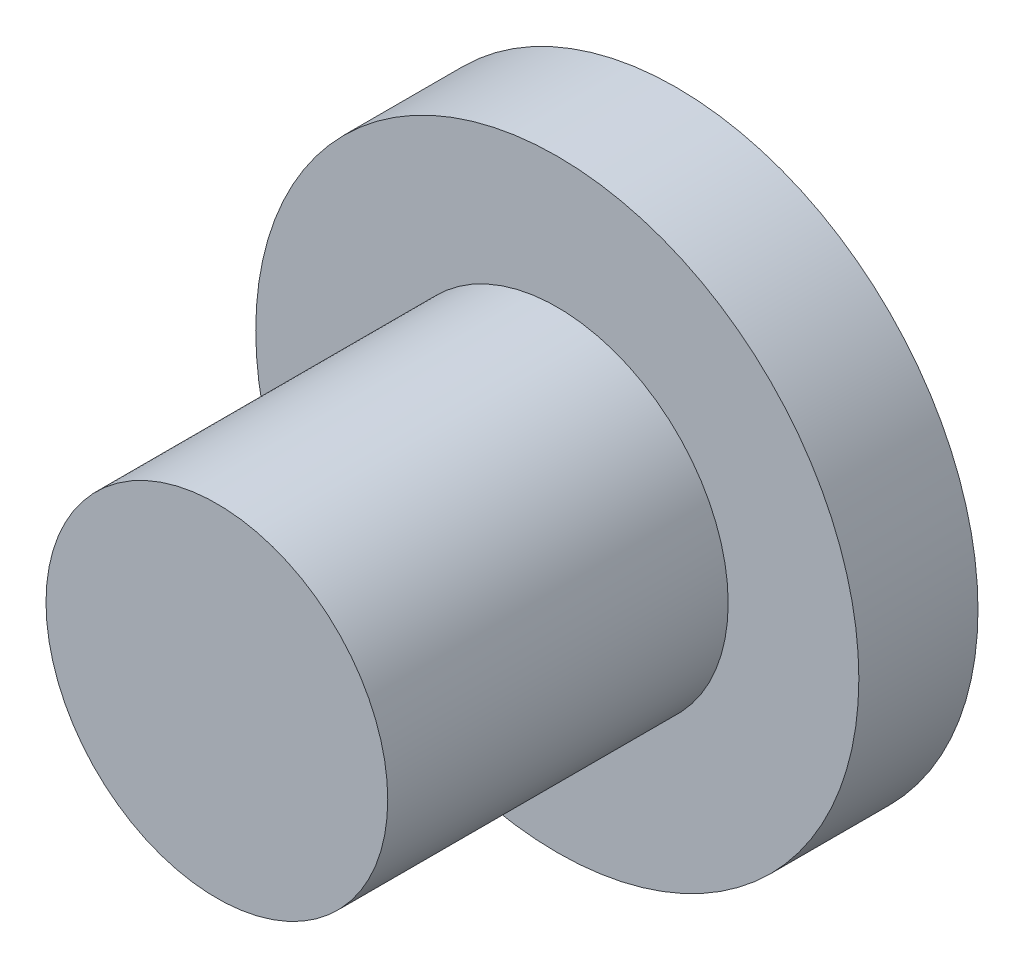
ISO-10303-21;
HEADER;
FILE_DESCRIPTION(('STEP AP214'),'2;1');
FILE_NAME('part.step','',(''),(''),'','','');
FILE_SCHEMA(('AUTOMOTIVE_DESIGN { 1 0 10303 214 1 1 1 1 }'));
ENDSEC;
DATA;
#1=APPLICATION_CONTEXT('core data for automotive mechanical design processes');
#2=APPLICATION_PROTOCOL_DEFINITION('international standard','automotive_design',2000,#1);
#3=PRODUCT_CONTEXT('',#1,'mechanical');
#4=PRODUCT('Part','Part','',(#3));
#5=PRODUCT_RELATED_PRODUCT_CATEGORY('part','',(#4));
#6=PRODUCT_DEFINITION_FORMATION('','',#4);
#7=PRODUCT_DEFINITION_CONTEXT('part definition',#1,'design');
#8=PRODUCT_DEFINITION('design','',#6,#7);
#9=PRODUCT_DEFINITION_SHAPE('','',#8);
#10=(LENGTH_UNIT() NAMED_UNIT(*) SI_UNIT(.MILLI.,.METRE.));
#11=(NAMED_UNIT(*) PLANE_ANGLE_UNIT() SI_UNIT($,.RADIAN.));
#12=(NAMED_UNIT(*) SI_UNIT($,.STERADIAN.) SOLID_ANGLE_UNIT());
#13=UNCERTAINTY_MEASURE_WITH_UNIT(LENGTH_MEASURE(1.E-05),#10,'distance_accuracy_value','');
#14=(GEOMETRIC_REPRESENTATION_CONTEXT(3) GLOBAL_UNCERTAINTY_ASSIGNED_CONTEXT((#13)) GLOBAL_UNIT_ASSIGNED_CONTEXT((#10,
#11,#12)) REPRESENTATION_CONTEXT('',''));
#15=CARTESIAN_POINT('',(0.,0.,0.));
#16=DIRECTION('',(0.,0.,1.));
#17=DIRECTION('',(1.,0.,0.));
#18=AXIS2_PLACEMENT_3D('',#15,#16,#17);
#19=CARTESIAN_POINT('',(-10.060269198017,7.74640728247308,1.778));
#20=DIRECTION('',(0.,0.,-1.));
#21=DIRECTION('',(-1.,0.,0.));
#22=AXIS2_PLACEMENT_3D('',#19,#20,#21);
#23=CYLINDRICAL_SURFACE('',#22,4.5);
#24=CARTESIAN_POINT('',(-10.060269198017,7.74640728247308,1.778));
#25=DIRECTION('',(0.,0.,1.));
#26=DIRECTION('',(1.,0.,0.));
#27=AXIS2_PLACEMENT_3D('',#24,#25,#26);
#28=CIRCLE('',#27,4.5);
#29=CARTESIAN_POINT('',(-5.560269198017,7.74640728247308,1.778));
#30=VERTEX_POINT('',#29);
#31=EDGE_CURVE('E38',#30,#30,#28,.T.);
#32=ORIENTED_EDGE('',*,*,#31,.F.);
#33=EDGE_LOOP('',(#32));
#34=FACE_BOUND('',#33,.T.);
#35=CARTESIAN_POINT('',(-10.060269198017,7.74640728247308,0.));
#36=DIRECTION('',(0.,0.,1.));
#37=DIRECTION('',(1.,0.,0.));
#38=AXIS2_PLACEMENT_3D('',#35,#36,#37);
#39=CIRCLE('',#38,4.5);
#40=CARTESIAN_POINT('',(-5.560269198017,7.74640728247308,0.));
#41=VERTEX_POINT('',#40);
#42=EDGE_CURVE('E34',#41,#41,#39,.T.);
#43=ORIENTED_EDGE('',*,*,#42,.T.);
#44=EDGE_LOOP('',(#43));
#45=FACE_BOUND('',#44,.T.);
#46=ADVANCED_FACE('F31',(#34,#45),#23,.T.);
#47=CARTESIAN_POINT('',(-10.060269198017,7.74640728247308,1.778));
#48=DIRECTION('',(0.,0.,1.));
#49=DIRECTION('',(1.,0.,0.));
#50=AXIS2_PLACEMENT_3D('',#47,#48,#49);
#51=PLANE('',#50);
#52=CARTESIAN_POINT('',(-10.060269198017,7.74640728247308,1.778));
#53=DIRECTION('',(0.,0.,1.));
#54=DIRECTION('',(1.,0.,0.));
#55=AXIS2_PLACEMENT_3D('',#52,#53,#54);
#56=CIRCLE('',#55,2.55);
#57=CARTESIAN_POINT('',(-7.510269198017,7.74640728247308,1.778));
#58=VERTEX_POINT('',#57);
#59=EDGE_CURVE('E10',#58,#58,#56,.T.);
#60=ORIENTED_EDGE('',*,*,#59,.F.);
#61=EDGE_LOOP('',(#60));
#62=FACE_BOUND('',#61,.T.);
#63=ORIENTED_EDGE('',*,*,#31,.T.);
#64=EDGE_LOOP('',(#63));
#65=FACE_BOUND('',#64,.T.);
#66=ADVANCED_FACE('F55',(#62,#65),#51,.T.);
#67=CARTESIAN_POINT('',(-10.060269198017,7.74640728247308,0.));
#68=DIRECTION('',(0.,0.,1.));
#69=DIRECTION('',(1.,0.,0.));
#70=AXIS2_PLACEMENT_3D('',#67,#68,#69);
#71=PLANE('',#70);
#72=ORIENTED_EDGE('',*,*,#42,.F.);
#73=EDGE_LOOP('',(#72));
#74=FACE_BOUND('',#73,.T.);
#75=ADVANCED_FACE('F52',(#74),#71,.F.);
#76=CARTESIAN_POINT('',(-10.060269198017,7.74640728247308,6.85800000000001));
#77=DIRECTION('',(0.,0.,-1.));
#78=DIRECTION('',(-1.,0.,0.));
#79=AXIS2_PLACEMENT_3D('',#76,#77,#78);
#80=CYLINDRICAL_SURFACE('',#79,2.55);
#81=CARTESIAN_POINT('',(-10.060269198017,7.74640728247308,6.85800000000001));
#82=DIRECTION('',(0.,0.,1.));
#83=DIRECTION('',(1.,0.,0.));
#84=AXIS2_PLACEMENT_3D('',#81,#82,#83);
#85=CIRCLE('',#84,2.55);
#86=CARTESIAN_POINT('',(-7.510269198017,7.74640728247308,6.85800000000001));
#87=VERTEX_POINT('',#86);
#88=EDGE_CURVE('E44',#87,#87,#85,.T.);
#89=ORIENTED_EDGE('',*,*,#88,.F.);
#90=EDGE_LOOP('',(#89));
#91=FACE_BOUND('',#90,.T.);
#92=ORIENTED_EDGE('',*,*,#59,.T.);
#93=EDGE_LOOP('',(#92));
#94=FACE_BOUND('',#93,.T.);
#95=ADVANCED_FACE('F54',(#91,#94),#80,.T.);
#96=CARTESIAN_POINT('',(-10.060269198017,7.74640728247308,6.85800000000001));
#97=DIRECTION('',(0.,0.,1.));
#98=DIRECTION('',(1.,0.,0.));
#99=AXIS2_PLACEMENT_3D('',#96,#97,#98);
#100=PLANE('',#99);
#101=ORIENTED_EDGE('',*,*,#88,.T.);
#102=EDGE_LOOP('',(#101));
#103=FACE_BOUND('',#102,.T.);
#104=ADVANCED_FACE('F60',(#103),#100,.T.);
#105=CLOSED_SHELL('',(#46,#66,#75,#95,#104));
#106=MANIFOLD_SOLID_BREP('B2',#105);
#107=ADVANCED_BREP_SHAPE_REPRESENTATION('',(#18,#106),#14);
#108=SHAPE_DEFINITION_REPRESENTATION(#9,#107);
ENDSEC;
END-ISO-10303-21;
